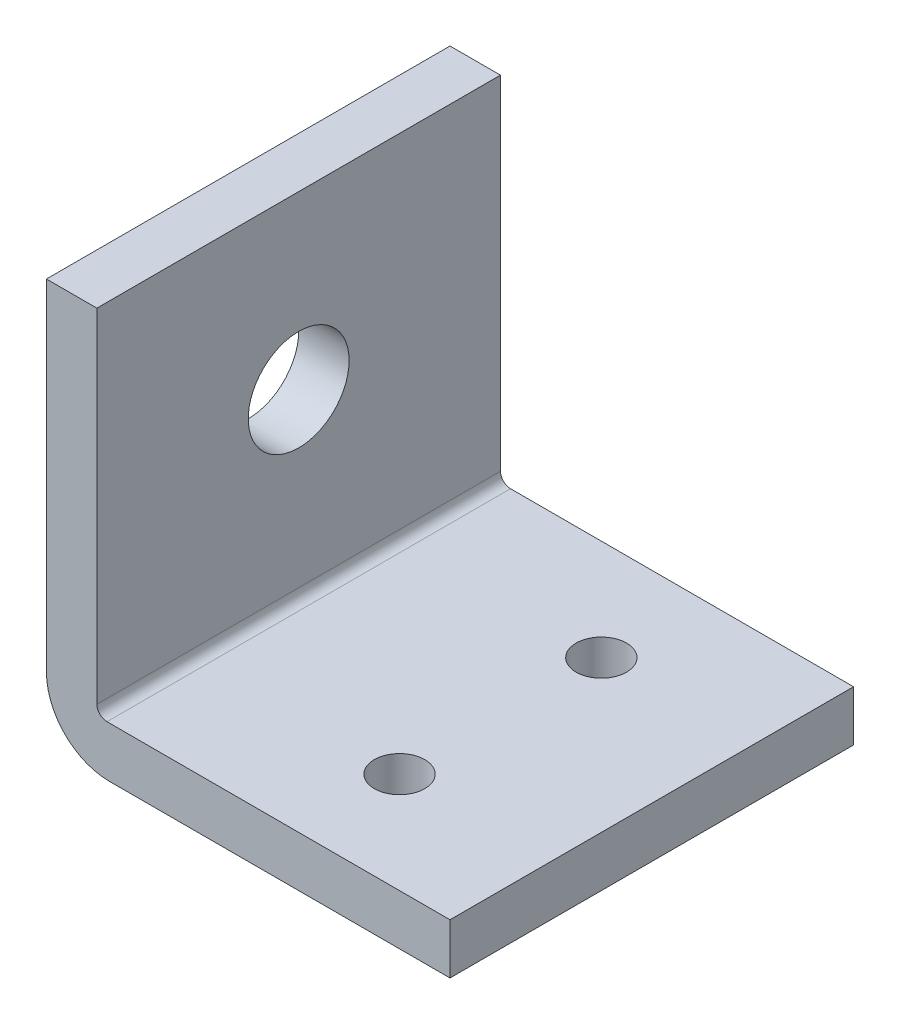
ISO-10303-21;
HEADER;
FILE_DESCRIPTION(('STEP AP214'),'2;1');
FILE_NAME('part.step','',(''),(''),'','','');
FILE_SCHEMA(('AUTOMOTIVE_DESIGN { 1 0 10303 214 1 1 1 1 }'));
ENDSEC;
DATA;
#1=APPLICATION_CONTEXT('core data for automotive mechanical design processes');
#2=APPLICATION_PROTOCOL_DEFINITION('international standard','automotive_design',2000,#1);
#3=PRODUCT_CONTEXT('',#1,'mechanical');
#4=PRODUCT('Part','Part','',(#3));
#5=PRODUCT_RELATED_PRODUCT_CATEGORY('part','',(#4));
#6=PRODUCT_DEFINITION_FORMATION('','',#4);
#7=PRODUCT_DEFINITION_CONTEXT('part definition',#1,'design');
#8=PRODUCT_DEFINITION('design','',#6,#7);
#9=PRODUCT_DEFINITION_SHAPE('','',#8);
#10=(LENGTH_UNIT() NAMED_UNIT(*) SI_UNIT(.MILLI.,.METRE.));
#11=(NAMED_UNIT(*) PLANE_ANGLE_UNIT() SI_UNIT($,.RADIAN.));
#12=(NAMED_UNIT(*) SI_UNIT($,.STERADIAN.) SOLID_ANGLE_UNIT());
#13=UNCERTAINTY_MEASURE_WITH_UNIT(LENGTH_MEASURE(1.E-05),#10,'distance_accuracy_value','');
#14=(GEOMETRIC_REPRESENTATION_CONTEXT(3) GLOBAL_UNCERTAINTY_ASSIGNED_CONTEXT((#13)) GLOBAL_UNIT_ASSIGNED_CONTEXT((#10,
#11,#12)) REPRESENTATION_CONTEXT('',''));
#15=CARTESIAN_POINT('',(0.,0.,0.));
#16=DIRECTION('',(0.,0.,1.));
#17=DIRECTION('',(1.,0.,0.));
#18=AXIS2_PLACEMENT_3D('',#15,#16,#17);
#19=CARTESIAN_POINT('',(0.,2.5,0.));
#20=DIRECTION('',(0.,-1.,0.));
#21=DIRECTION('',(0.,0.,-1.));
#22=AXIS2_PLACEMENT_3D('',#19,#20,#21);
#23=PLANE('',#22);
#24=CARTESIAN_POINT('',(5.,2.5,10.));
#25=DIRECTION('',(0.,1.,0.));
#26=DIRECTION('',(0.,0.,-1.));
#27=AXIS2_PLACEMENT_3D('',#24,#25,#26);
#28=CIRCLE('',#27,2.5);
#29=CARTESIAN_POINT('',(5.,2.5,7.5));
#30=VERTEX_POINT('',#29);
#31=EDGE_CURVE('E298',#30,#30,#28,.T.);
#32=ORIENTED_EDGE('',*,*,#31,.F.);
#33=EDGE_LOOP('',(#32));
#34=FACE_BOUND('',#33,.T.);
#35=CARTESIAN_POINT('',(5.,2.5,-10.));
#36=DIRECTION('',(0.,1.,0.));
#37=DIRECTION('',(0.,0.,1.));
#38=AXIS2_PLACEMENT_3D('',#35,#36,#37);
#39=CIRCLE('',#38,2.5);
#40=CARTESIAN_POINT('',(5.,2.5,-7.5));
#41=VERTEX_POINT('',#40);
#42=EDGE_CURVE('E126',#41,#41,#39,.T.);
#43=ORIENTED_EDGE('',*,*,#42,.F.);
#44=EDGE_LOOP('',(#43));
#45=FACE_BOUND('',#44,.T.);
#46=DIRECTION('',(-1.,0.,0.));
#47=VECTOR('',#46,1.);
#48=CARTESIAN_POINT('',(-20.,2.5,-20.));
#49=LINE('',#48,#47);
#50=CARTESIAN_POINT('',(20.,2.5,-20.));
#51=VERTEX_POINT('',#50);
#52=CARTESIAN_POINT('',(-14.,2.5,-20.));
#53=VERTEX_POINT('',#52);
#54=EDGE_CURVE('E136',#51,#53,#49,.T.);
#55=ORIENTED_EDGE('',*,*,#54,.T.);
#56=DIRECTION('',(0.,0.,-1.));
#57=VECTOR('',#56,1.);
#58=CARTESIAN_POINT('',(-14.,2.5,20.));
#59=LINE('',#58,#57);
#60=CARTESIAN_POINT('',(-14.,2.5,20.));
#61=VERTEX_POINT('',#60);
#62=EDGE_CURVE('E55',#53,#61,#59,.F.);
#63=ORIENTED_EDGE('',*,*,#62,.T.);
#64=DIRECTION('',(1.,0.,0.));
#65=VECTOR('',#64,1.);
#66=CARTESIAN_POINT('',(-20.,2.5,20.));
#67=LINE('',#66,#65);
#68=CARTESIAN_POINT('',(20.,2.5,20.));
#69=VERTEX_POINT('',#68);
#70=EDGE_CURVE('E145',#61,#69,#67,.T.);
#71=ORIENTED_EDGE('',*,*,#70,.T.);
#72=DIRECTION('',(0.,0.,-1.));
#73=VECTOR('',#72,1.);
#74=CARTESIAN_POINT('',(20.,2.5,20.));
#75=LINE('',#74,#73);
#76=EDGE_CURVE('E133',#69,#51,#75,.T.);
#77=ORIENTED_EDGE('',*,*,#76,.T.);
#78=EDGE_LOOP('',(#55,#63,#71,#77));
#79=FACE_BOUND('',#78,.T.);
#80=ADVANCED_FACE('F34',(#34,#45,#79),#23,.F.);
#81=CARTESIAN_POINT('',(20.,2.5,20.));
#82=DIRECTION('',(-1.,0.,0.));
#83=DIRECTION('',(0.,0.,1.));
#84=AXIS2_PLACEMENT_3D('',#81,#82,#83);
#85=PLANE('',#84);
#86=DIRECTION('',(0.,0.,-1.));
#87=VECTOR('',#86,1.);
#88=CARTESIAN_POINT('',(20.,-2.5,20.));
#89=LINE('',#88,#87);
#90=CARTESIAN_POINT('',(20.,-2.5,20.));
#91=VERTEX_POINT('',#90);
#92=CARTESIAN_POINT('',(20.,-2.5,-20.));
#93=VERTEX_POINT('',#92);
#94=EDGE_CURVE('E152',#91,#93,#89,.T.);
#95=ORIENTED_EDGE('',*,*,#94,.T.);
#96=DIRECTION('',(0.,-1.,0.));
#97=VECTOR('',#96,1.);
#98=CARTESIAN_POINT('',(20.,2.5,-20.));
#99=LINE('',#98,#97);
#100=EDGE_CURVE('E146',#51,#93,#99,.T.);
#101=ORIENTED_EDGE('',*,*,#100,.F.);
#102=ORIENTED_EDGE('',*,*,#76,.F.);
#103=DIRECTION('',(0.,-1.,0.));
#104=VECTOR('',#103,1.);
#105=CARTESIAN_POINT('',(20.,2.5,20.));
#106=LINE('',#105,#104);
#107=EDGE_CURVE('E108',#69,#91,#106,.T.);
#108=ORIENTED_EDGE('',*,*,#107,.T.);
#109=EDGE_LOOP('',(#95,#101,#102,#108));
#110=FACE_BOUND('',#109,.T.);
#111=ADVANCED_FACE('F181',(#110),#85,.F.);
#112=CARTESIAN_POINT('',(-20.,2.5,-20.));
#113=DIRECTION('',(0.,0.,1.));
#114=DIRECTION('',(1.,0.,0.));
#115=AXIS2_PLACEMENT_3D('',#112,#113,#114);
#116=PLANE('',#115);
#117=DIRECTION('',(-1.,0.,0.));
#118=VECTOR('',#117,1.);
#119=CARTESIAN_POINT('',(-20.,-2.5,-20.));
#120=LINE('',#119,#118);
#121=CARTESIAN_POINT('',(-13.75,-2.5,-20.));
#122=VERTEX_POINT('',#121);
#123=EDGE_CURVE('E179',#93,#122,#120,.T.);
#124=ORIENTED_EDGE('',*,*,#123,.T.);
#125=CARTESIAN_POINT('',(-13.75,3.75,-20.));
#126=DIRECTION('',(0.,0.,1.));
#127=DIRECTION('',(1.,0.,0.));
#128=AXIS2_PLACEMENT_3D('',#125,#126,#127);
#129=CIRCLE('',#128,6.25);
#130=CARTESIAN_POINT('',(-20.,3.75,-20.));
#131=VERTEX_POINT('',#130);
#132=EDGE_CURVE('E160',#122,#131,#129,.F.);
#133=ORIENTED_EDGE('',*,*,#132,.T.);
#134=DIRECTION('',(0.,-1.,0.));
#135=VECTOR('',#134,1.);
#136=CARTESIAN_POINT('',(-20.,2.5,-20.));
#137=LINE('',#136,#135);
#138=CARTESIAN_POINT('',(-20.,37.5,-20.));
#139=VERTEX_POINT('',#138);
#140=EDGE_CURVE('E107',#139,#131,#137,.T.);
#141=ORIENTED_EDGE('',*,*,#140,.F.);
#142=DIRECTION('',(-1.,0.,0.));
#143=VECTOR('',#142,1.);
#144=CARTESIAN_POINT('',(-20.,37.5,-20.));
#145=LINE('',#144,#143);
#146=CARTESIAN_POINT('',(-15.,37.5,-20.));
#147=VERTEX_POINT('',#146);
#148=EDGE_CURVE('E122',#147,#139,#145,.T.);
#149=ORIENTED_EDGE('',*,*,#148,.F.);
#150=DIRECTION('',(0.,-1.,0.));
#151=VECTOR('',#150,1.);
#152=CARTESIAN_POINT('',(-15.,37.5,-20.));
#153=LINE('',#152,#151);
#154=CARTESIAN_POINT('',(-15.,3.5,-20.));
#155=VERTEX_POINT('',#154);
#156=EDGE_CURVE('E132',#147,#155,#153,.T.);
#157=ORIENTED_EDGE('',*,*,#156,.T.);
#158=CARTESIAN_POINT('',(-14.,3.5,-20.));
#159=DIRECTION('',(0.,0.,1.));
#160=DIRECTION('',(1.,0.,0.));
#161=AXIS2_PLACEMENT_3D('',#158,#159,#160);
#162=CIRCLE('',#161,1.);
#163=EDGE_CURVE('E42',#155,#53,#162,.T.);
#164=ORIENTED_EDGE('',*,*,#163,.T.);
#165=ORIENTED_EDGE('',*,*,#54,.F.);
#166=ORIENTED_EDGE('',*,*,#100,.T.);
#167=EDGE_LOOP('',(#124,#133,#141,#149,#157,#164,#165,#166));
#168=FACE_BOUND('',#167,.T.);
#169=ADVANCED_FACE('F178',(#168),#116,.F.);
#170=CARTESIAN_POINT('',(-20.,2.5,20.));
#171=DIRECTION('',(1.,0.,0.));
#172=DIRECTION('',(0.,0.,-1.));
#173=AXIS2_PLACEMENT_3D('',#170,#171,#172);
#174=PLANE('',#173);
#175=CARTESIAN_POINT('',(-20.,20.5,0.));
#176=DIRECTION('',(1.,0.,0.));
#177=DIRECTION('',(0.,0.,-1.));
#178=AXIS2_PLACEMENT_3D('',#175,#176,#177);
#179=CIRCLE('',#178,5.);
#180=CARTESIAN_POINT('',(-20.,20.5,-5.));
#181=VERTEX_POINT('',#180);
#182=EDGE_CURVE('E293',#181,#181,#179,.T.);
#183=ORIENTED_EDGE('',*,*,#182,.T.);
#184=EDGE_LOOP('',(#183));
#185=FACE_BOUND('',#184,.T.);
#186=ORIENTED_EDGE('',*,*,#140,.T.);
#187=DIRECTION('',(0.,0.,1.));
#188=VECTOR('',#187,1.);
#189=CARTESIAN_POINT('',(-20.,3.75,20.));
#190=LINE('',#189,#188);
#191=CARTESIAN_POINT('',(-20.,3.75,20.));
#192=VERTEX_POINT('',#191);
#193=EDGE_CURVE('E105',#131,#192,#190,.T.);
#194=ORIENTED_EDGE('',*,*,#193,.T.);
#195=DIRECTION('',(0.,-1.,0.));
#196=VECTOR('',#195,1.);
#197=CARTESIAN_POINT('',(-20.,2.5,20.));
#198=LINE('',#197,#196);
#199=CARTESIAN_POINT('',(-20.,37.5,20.));
#200=VERTEX_POINT('',#199);
#201=EDGE_CURVE('E98',#200,#192,#198,.T.);
#202=ORIENTED_EDGE('',*,*,#201,.F.);
#203=DIRECTION('',(0.,0.,1.));
#204=VECTOR('',#203,1.);
#205=CARTESIAN_POINT('',(-20.,37.5,20.));
#206=LINE('',#205,#204);
#207=EDGE_CURVE('E103',#139,#200,#206,.T.);
#208=ORIENTED_EDGE('',*,*,#207,.F.);
#209=EDGE_LOOP('',(#186,#194,#202,#208));
#210=FACE_BOUND('',#209,.T.);
#211=ADVANCED_FACE('F101',(#185,#210),#174,.F.);
#212=CARTESIAN_POINT('',(-20.,2.5,20.));
#213=DIRECTION('',(0.,0.,-1.));
#214=DIRECTION('',(-1.,0.,0.));
#215=AXIS2_PLACEMENT_3D('',#212,#213,#214);
#216=PLANE('',#215);
#217=ORIENTED_EDGE('',*,*,#201,.T.);
#218=CARTESIAN_POINT('',(-13.75,3.75,20.));
#219=DIRECTION('',(0.,0.,-1.));
#220=DIRECTION('',(-1.,0.,0.));
#221=AXIS2_PLACEMENT_3D('',#218,#219,#220);
#222=CIRCLE('',#221,6.25);
#223=CARTESIAN_POINT('',(-13.75,-2.5,20.));
#224=VERTEX_POINT('',#223);
#225=EDGE_CURVE('E156',#192,#224,#222,.F.);
#226=ORIENTED_EDGE('',*,*,#225,.T.);
#227=DIRECTION('',(1.,0.,0.));
#228=VECTOR('',#227,1.);
#229=CARTESIAN_POINT('',(-20.,-2.5,20.));
#230=LINE('',#229,#228);
#231=EDGE_CURVE('E137',#224,#91,#230,.T.);
#232=ORIENTED_EDGE('',*,*,#231,.T.);
#233=ORIENTED_EDGE('',*,*,#107,.F.);
#234=ORIENTED_EDGE('',*,*,#70,.F.);
#235=CARTESIAN_POINT('',(-14.,3.5,20.));
#236=DIRECTION('',(0.,0.,-1.));
#237=DIRECTION('',(-1.,0.,0.));
#238=AXIS2_PLACEMENT_3D('',#235,#236,#237);
#239=CIRCLE('',#238,1.);
#240=CARTESIAN_POINT('',(-15.,3.5,20.));
#241=VERTEX_POINT('',#240);
#242=EDGE_CURVE('E11',#61,#241,#239,.T.);
#243=ORIENTED_EDGE('',*,*,#242,.T.);
#244=DIRECTION('',(0.,-1.,0.));
#245=VECTOR('',#244,1.);
#246=CARTESIAN_POINT('',(-15.,37.5,20.));
#247=LINE('',#246,#245);
#248=CARTESIAN_POINT('',(-15.,37.5,20.));
#249=VERTEX_POINT('',#248);
#250=EDGE_CURVE('E114',#249,#241,#247,.T.);
#251=ORIENTED_EDGE('',*,*,#250,.F.);
#252=DIRECTION('',(1.,0.,0.));
#253=VECTOR('',#252,1.);
#254=CARTESIAN_POINT('',(-20.,37.5,20.));
#255=LINE('',#254,#253);
#256=EDGE_CURVE('E111',#200,#249,#255,.T.);
#257=ORIENTED_EDGE('',*,*,#256,.F.);
#258=EDGE_LOOP('',(#217,#226,#232,#233,#234,#243,#251,#257));
#259=FACE_BOUND('',#258,.T.);
#260=ADVANCED_FACE('F112',(#259),#216,.F.);
#261=CARTESIAN_POINT('',(0.,-2.5,0.));
#262=DIRECTION('',(0.,-1.,0.));
#263=DIRECTION('',(0.,0.,-1.));
#264=AXIS2_PLACEMENT_3D('',#261,#262,#263);
#265=PLANE('',#264);
#266=CARTESIAN_POINT('',(5.,-2.5,10.));
#267=DIRECTION('',(0.,1.,0.));
#268=DIRECTION('',(0.,0.,-1.));
#269=AXIS2_PLACEMENT_3D('',#266,#267,#268);
#270=CIRCLE('',#269,2.5);
#271=CARTESIAN_POINT('',(5.,-2.5,7.5));
#272=VERTEX_POINT('',#271);
#273=EDGE_CURVE('E301',#272,#272,#270,.T.);
#274=ORIENTED_EDGE('',*,*,#273,.T.);
#275=EDGE_LOOP('',(#274));
#276=FACE_BOUND('',#275,.T.);
#277=CARTESIAN_POINT('',(5.,-2.5,-10.));
#278=DIRECTION('',(0.,1.,0.));
#279=DIRECTION('',(0.,0.,1.));
#280=AXIS2_PLACEMENT_3D('',#277,#278,#279);
#281=CIRCLE('',#280,2.5);
#282=CARTESIAN_POINT('',(5.,-2.5,-7.5));
#283=VERTEX_POINT('',#282);
#284=EDGE_CURVE('E123',#283,#283,#281,.T.);
#285=ORIENTED_EDGE('',*,*,#284,.T.);
#286=EDGE_LOOP('',(#285));
#287=FACE_BOUND('',#286,.T.);
#288=ORIENTED_EDGE('',*,*,#231,.F.);
#289=DIRECTION('',(0.,0.,1.));
#290=VECTOR('',#289,1.);
#291=CARTESIAN_POINT('',(-13.75,-2.5,-20.));
#292=LINE('',#291,#290);
#293=EDGE_CURVE('E158',#224,#122,#292,.F.);
#294=ORIENTED_EDGE('',*,*,#293,.T.);
#295=ORIENTED_EDGE('',*,*,#123,.F.);
#296=ORIENTED_EDGE('',*,*,#94,.F.);
#297=EDGE_LOOP('',(#288,#294,#295,#296));
#298=FACE_BOUND('',#297,.T.);
#299=ADVANCED_FACE('F185',(#276,#287,#298),#265,.T.);
#300=CARTESIAN_POINT('',(-15.,37.5,20.));
#301=DIRECTION('',(-1.,0.,0.));
#302=DIRECTION('',(0.,0.,1.));
#303=AXIS2_PLACEMENT_3D('',#300,#301,#302);
#304=PLANE('',#303);
#305=CARTESIAN_POINT('',(-15.,20.5,0.));
#306=DIRECTION('',(1.,0.,0.));
#307=DIRECTION('',(0.,0.,-1.));
#308=AXIS2_PLACEMENT_3D('',#305,#306,#307);
#309=CIRCLE('',#308,5.);
#310=CARTESIAN_POINT('',(-15.,20.5,-5.));
#311=VERTEX_POINT('',#310);
#312=EDGE_CURVE('E296',#311,#311,#309,.T.);
#313=ORIENTED_EDGE('',*,*,#312,.F.);
#314=EDGE_LOOP('',(#313));
#315=FACE_BOUND('',#314,.T.);
#316=ORIENTED_EDGE('',*,*,#250,.T.);
#317=DIRECTION('',(0.,0.,-1.));
#318=VECTOR('',#317,1.);
#319=CARTESIAN_POINT('',(-15.,3.5,-20.));
#320=LINE('',#319,#318);
#321=EDGE_CURVE('E162',#241,#155,#320,.T.);
#322=ORIENTED_EDGE('',*,*,#321,.T.);
#323=ORIENTED_EDGE('',*,*,#156,.F.);
#324=DIRECTION('',(0.,0.,-1.));
#325=VECTOR('',#324,1.);
#326=CARTESIAN_POINT('',(-15.,37.5,20.));
#327=LINE('',#326,#325);
#328=EDGE_CURVE('E117',#249,#147,#327,.T.);
#329=ORIENTED_EDGE('',*,*,#328,.F.);
#330=EDGE_LOOP('',(#316,#322,#323,#329));
#331=FACE_BOUND('',#330,.T.);
#332=ADVANCED_FACE('F190',(#315,#331),#304,.F.);
#333=CARTESIAN_POINT('',(0.,37.5,0.));
#334=DIRECTION('',(0.,-1.,0.));
#335=DIRECTION('',(0.,0.,-1.));
#336=AXIS2_PLACEMENT_3D('',#333,#334,#335);
#337=PLANE('',#336);
#338=ORIENTED_EDGE('',*,*,#207,.T.);
#339=ORIENTED_EDGE('',*,*,#256,.T.);
#340=ORIENTED_EDGE('',*,*,#328,.T.);
#341=ORIENTED_EDGE('',*,*,#148,.T.);
#342=EDGE_LOOP('',(#338,#339,#340,#341));
#343=FACE_BOUND('',#342,.T.);
#344=ADVANCED_FACE('F120',(#343),#337,.F.);
#345=CARTESIAN_POINT('',(-13.75,3.75,20.));
#346=DIRECTION('',(0.,0.,-1.));
#347=DIRECTION('',(-1.,0.,0.));
#348=AXIS2_PLACEMENT_3D('',#345,#346,#347);
#349=CYLINDRICAL_SURFACE('',#348,6.25);
#350=ORIENTED_EDGE('',*,*,#132,.F.);
#351=ORIENTED_EDGE('',*,*,#293,.F.);
#352=ORIENTED_EDGE('',*,*,#225,.F.);
#353=ORIENTED_EDGE('',*,*,#193,.F.);
#354=EDGE_LOOP('',(#350,#351,#352,#353));
#355=FACE_BOUND('',#354,.T.);
#356=ADVANCED_FACE('F187',(#355),#349,.T.);
#357=CARTESIAN_POINT('',(-14.,3.5,20.));
#358=DIRECTION('',(0.,0.,1.));
#359=DIRECTION('',(1.,0.,0.));
#360=AXIS2_PLACEMENT_3D('',#357,#358,#359);
#361=CYLINDRICAL_SURFACE('',#360,1.);
#362=ORIENTED_EDGE('',*,*,#242,.F.);
#363=ORIENTED_EDGE('',*,*,#62,.F.);
#364=ORIENTED_EDGE('',*,*,#163,.F.);
#365=ORIENTED_EDGE('',*,*,#321,.F.);
#366=EDGE_LOOP('',(#362,#363,#364,#365));
#367=FACE_BOUND('',#366,.T.);
#368=ADVANCED_FACE('F36',(#367),#361,.F.);
#369=CARTESIAN_POINT('',(5.,-2.5,-10.));
#370=DIRECTION('',(0.,1.,0.));
#371=DIRECTION('',(0.,0.,1.));
#372=AXIS2_PLACEMENT_3D('',#369,#370,#371);
#373=CYLINDRICAL_SURFACE('',#372,2.5);
#374=ORIENTED_EDGE('',*,*,#284,.F.);
#375=EDGE_LOOP('',(#374));
#376=FACE_BOUND('',#375,.T.);
#377=ORIENTED_EDGE('',*,*,#42,.T.);
#378=EDGE_LOOP('',(#377));
#379=FACE_BOUND('',#378,.T.);
#380=ADVANCED_FACE('F195',(#376,#379),#373,.F.);
#381=CARTESIAN_POINT('',(5.,-2.5,10.));
#382=DIRECTION('',(0.,1.,0.));
#383=DIRECTION('',(0.,0.,1.));
#384=AXIS2_PLACEMENT_3D('',#381,#382,#383);
#385=CYLINDRICAL_SURFACE('',#384,2.5);
#386=ORIENTED_EDGE('',*,*,#273,.F.);
#387=EDGE_LOOP('',(#386));
#388=FACE_BOUND('',#387,.T.);
#389=ORIENTED_EDGE('',*,*,#31,.T.);
#390=EDGE_LOOP('',(#389));
#391=FACE_BOUND('',#390,.T.);
#392=ADVANCED_FACE('F200',(#388,#391),#385,.F.);
#393=CARTESIAN_POINT('',(-20.,20.5,0.));
#394=DIRECTION('',(1.,0.,0.));
#395=DIRECTION('',(0.,0.,-1.));
#396=AXIS2_PLACEMENT_3D('',#393,#394,#395);
#397=CYLINDRICAL_SURFACE('',#396,5.);
#398=ORIENTED_EDGE('',*,*,#182,.F.);
#399=EDGE_LOOP('',(#398));
#400=FACE_BOUND('',#399,.T.);
#401=ORIENTED_EDGE('',*,*,#312,.T.);
#402=EDGE_LOOP('',(#401));
#403=FACE_BOUND('',#402,.T.);
#404=ADVANCED_FACE('F277',(#400,#403),#397,.F.);
#405=CLOSED_SHELL('',(#80,#111,#169,#211,#260,#299,#332,#344,#356,#368,#380,#392,#404));
#406=MANIFOLD_SOLID_BREP('B2',#405);
#407=ADVANCED_BREP_SHAPE_REPRESENTATION('',(#18,#406),#14);
#408=SHAPE_DEFINITION_REPRESENTATION(#9,#407);
ENDSEC;
END-ISO-10303-21;
